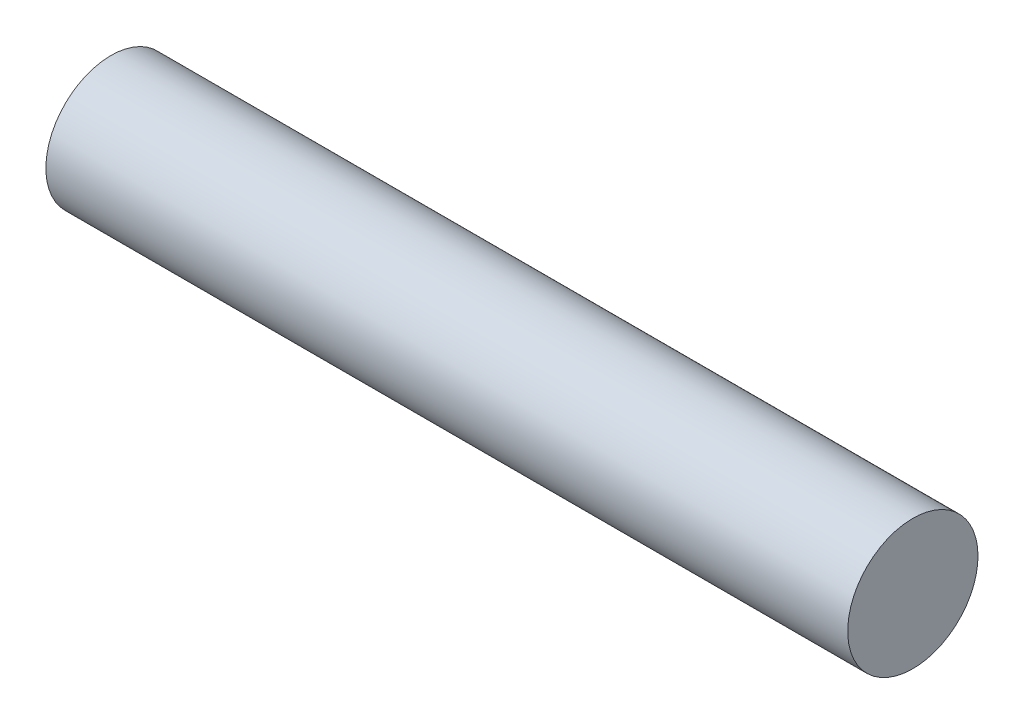
ISO-10303-21;
HEADER;
FILE_DESCRIPTION(('STEP AP214'),'2;1');
FILE_NAME('part.step','',(''),(''),'','','');
FILE_SCHEMA(('AUTOMOTIVE_DESIGN { 1 0 10303 214 1 1 1 1 }'));
ENDSEC;
DATA;
#1=APPLICATION_CONTEXT('core data for automotive mechanical design processes');
#2=APPLICATION_PROTOCOL_DEFINITION('international standard','automotive_design',2000,#1);
#3=PRODUCT_CONTEXT('',#1,'mechanical');
#4=PRODUCT('Part','Part','',(#3));
#5=PRODUCT_RELATED_PRODUCT_CATEGORY('part','',(#4));
#6=PRODUCT_DEFINITION_FORMATION('','',#4);
#7=PRODUCT_DEFINITION_CONTEXT('part definition',#1,'design');
#8=PRODUCT_DEFINITION('design','',#6,#7);
#9=PRODUCT_DEFINITION_SHAPE('','',#8);
#10=(LENGTH_UNIT() NAMED_UNIT(*) SI_UNIT(.MILLI.,.METRE.));
#11=(NAMED_UNIT(*) PLANE_ANGLE_UNIT() SI_UNIT($,.RADIAN.));
#12=(NAMED_UNIT(*) SI_UNIT($,.STERADIAN.) SOLID_ANGLE_UNIT());
#13=UNCERTAINTY_MEASURE_WITH_UNIT(LENGTH_MEASURE(1.E-05),#10,'distance_accuracy_value','');
#14=(GEOMETRIC_REPRESENTATION_CONTEXT(3) GLOBAL_UNCERTAINTY_ASSIGNED_CONTEXT((#13)) GLOBAL_UNIT_ASSIGNED_CONTEXT((#10,
#11,#12)) REPRESENTATION_CONTEXT('',''));
#15=CARTESIAN_POINT('',(0.,0.,0.));
#16=DIRECTION('',(0.,0.,1.));
#17=DIRECTION('',(1.,0.,0.));
#18=AXIS2_PLACEMENT_3D('',#15,#16,#17);
#19=CARTESIAN_POINT('',(20.,0.,0.));
#20=DIRECTION('',(-1.,0.,0.));
#21=DIRECTION('',(0.,0.,1.));
#22=AXIS2_PLACEMENT_3D('',#19,#20,#21);
#23=CYLINDRICAL_SURFACE('',#22,3.25);
#24=CARTESIAN_POINT('',(20.,0.,0.));
#25=DIRECTION('',(1.,0.,0.));
#26=DIRECTION('',(0.,0.,-1.));
#27=AXIS2_PLACEMENT_3D('',#24,#25,#26);
#28=CIRCLE('',#27,3.25);
#29=CARTESIAN_POINT('',(20.,0.,-3.25));
#30=VERTEX_POINT('',#29);
#31=EDGE_CURVE('E10',#30,#30,#28,.T.);
#32=ORIENTED_EDGE('',*,*,#31,.F.);
#33=EDGE_LOOP('',(#32));
#34=FACE_BOUND('',#33,.T.);
#35=CARTESIAN_POINT('',(-20.,0.,0.));
#36=DIRECTION('',(1.,0.,0.));
#37=DIRECTION('',(0.,0.,-1.));
#38=AXIS2_PLACEMENT_3D('',#35,#36,#37);
#39=CIRCLE('',#38,3.25);
#40=CARTESIAN_POINT('',(-20.,0.,-3.25));
#41=VERTEX_POINT('',#40);
#42=EDGE_CURVE('E44',#41,#41,#39,.T.);
#43=ORIENTED_EDGE('',*,*,#42,.T.);
#44=EDGE_LOOP('',(#43));
#45=FACE_BOUND('',#44,.T.);
#46=ADVANCED_FACE('F41',(#34,#45),#23,.T.);
#47=CARTESIAN_POINT('',(20.,0.,0.));
#48=DIRECTION('',(1.,0.,0.));
#49=DIRECTION('',(0.,0.,-1.));
#50=AXIS2_PLACEMENT_3D('',#47,#48,#49);
#51=PLANE('',#50);
#52=ORIENTED_EDGE('',*,*,#31,.T.);
#53=EDGE_LOOP('',(#52));
#54=FACE_BOUND('',#53,.T.);
#55=ADVANCED_FACE('F58',(#54),#51,.T.);
#56=CARTESIAN_POINT('',(-20.,0.,0.));
#57=DIRECTION('',(1.,0.,0.));
#58=DIRECTION('',(0.,0.,-1.));
#59=AXIS2_PLACEMENT_3D('',#56,#57,#58);
#60=PLANE('',#59);
#61=ORIENTED_EDGE('',*,*,#42,.F.);
#62=EDGE_LOOP('',(#61));
#63=FACE_BOUND('',#62,.T.);
#64=ADVANCED_FACE('F56',(#63),#60,.F.);
#65=CLOSED_SHELL('',(#46,#55,#64));
#66=MANIFOLD_SOLID_BREP('B2',#65);
#67=ADVANCED_BREP_SHAPE_REPRESENTATION('',(#18,#66),#14);
#68=SHAPE_DEFINITION_REPRESENTATION(#9,#67);
ENDSEC;
END-ISO-10303-21;
